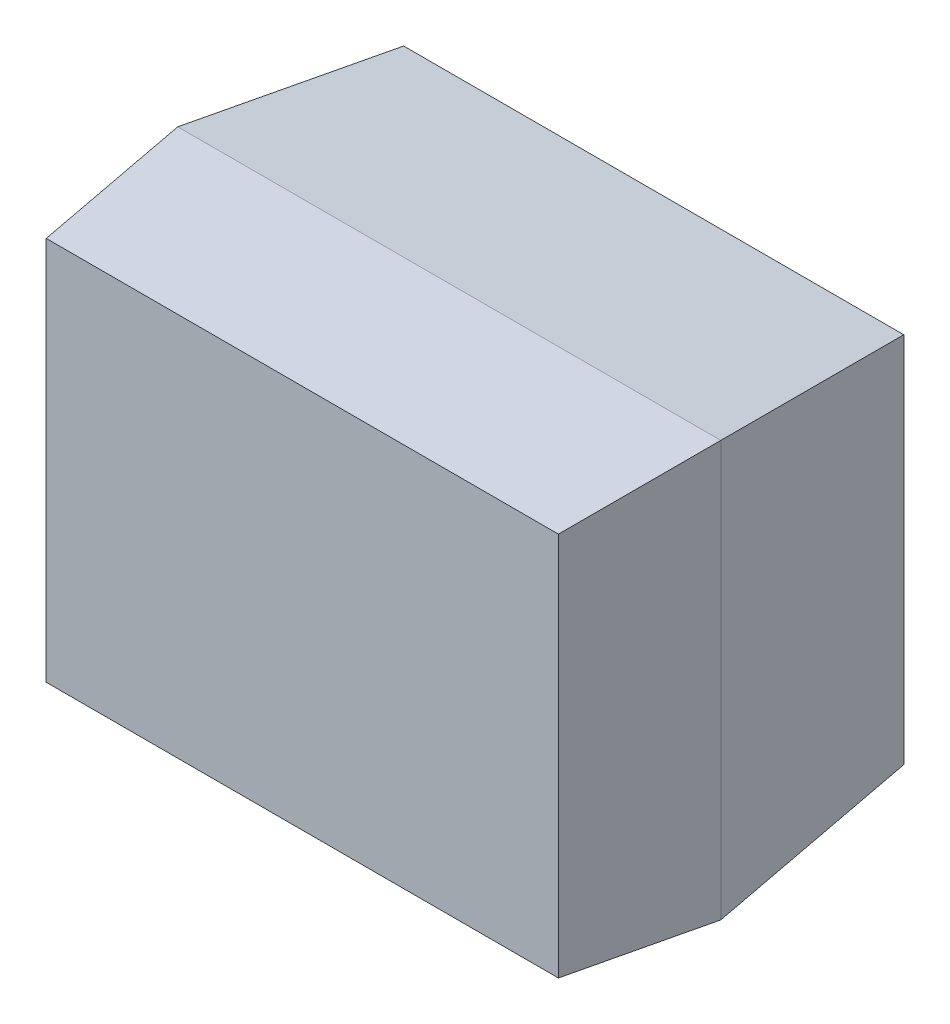
ISO-10303-21;
HEADER;
FILE_DESCRIPTION(('STEP AP214'),'2;1');
FILE_NAME('part.step','',(''),(''),'','','');
FILE_SCHEMA(('AUTOMOTIVE_DESIGN { 1 0 10303 214 1 1 1 1 }'));
ENDSEC;
DATA;
#1=APPLICATION_CONTEXT('core data for automotive mechanical design processes');
#2=APPLICATION_PROTOCOL_DEFINITION('international standard','automotive_design',2000,#1);
#3=PRODUCT_CONTEXT('',#1,'mechanical');
#4=PRODUCT('Part','Part','',(#3));
#5=PRODUCT_RELATED_PRODUCT_CATEGORY('part','',(#4));
#6=PRODUCT_DEFINITION_FORMATION('','',#4);
#7=PRODUCT_DEFINITION_CONTEXT('part definition',#1,'design');
#8=PRODUCT_DEFINITION('design','',#6,#7);
#9=PRODUCT_DEFINITION_SHAPE('','',#8);
#10=(LENGTH_UNIT() NAMED_UNIT(*) SI_UNIT(.MILLI.,.METRE.));
#11=(NAMED_UNIT(*) PLANE_ANGLE_UNIT() SI_UNIT($,.RADIAN.));
#12=(NAMED_UNIT(*) SI_UNIT($,.STERADIAN.) SOLID_ANGLE_UNIT());
#13=UNCERTAINTY_MEASURE_WITH_UNIT(LENGTH_MEASURE(1.E-05),#10,'distance_accuracy_value','');
#14=(GEOMETRIC_REPRESENTATION_CONTEXT(3) GLOBAL_UNCERTAINTY_ASSIGNED_CONTEXT((#13)) GLOBAL_UNIT_ASSIGNED_CONTEXT((#10,
#11,#12)) REPRESENTATION_CONTEXT('',''));
#15=CARTESIAN_POINT('',(0.,0.,0.));
#16=DIRECTION('',(0.,0.,1.));
#17=DIRECTION('',(1.,0.,0.));
#18=AXIS2_PLACEMENT_3D('',#15,#16,#17);
#19=CARTESIAN_POINT('',(0.425,0.616366644714984,0.42));
#20=DIRECTION('',(0.,0.994521895368273,-0.104528463267653));
#21=DIRECTION('',(0.,0.104528463267653,0.994521895368274));
#22=AXIS2_PLACEMENT_3D('',#19,#20,#21);
#23=PLANE('',#22);
#24=DIRECTION('',(-0.103962051184497,0.103962051184498,0.989132844377854));
#25=VECTOR('',#24,1.);
#26=CARTESIAN_POINT('',(-0.782733289429968,0.582733289429967,0.1));
#27=LINE('',#26,#25);
#28=CARTESIAN_POINT('',(-0.782733289429968,0.582733289429967,0.1));
#29=VERTEX_POINT('',#28);
#30=CARTESIAN_POINT('',(-0.85,0.65,0.74));
#31=VERTEX_POINT('',#30);
#32=EDGE_CURVE('E11',#29,#31,#27,.T.);
#33=ORIENTED_EDGE('',*,*,#32,.T.);
#34=DIRECTION('',(-1.,0.,0.));
#35=VECTOR('',#34,1.);
#36=CARTESIAN_POINT('',(0.85,0.65,0.74));
#37=LINE('',#36,#35);
#38=CARTESIAN_POINT('',(0.85,0.65,0.74));
#39=VERTEX_POINT('',#38);
#40=EDGE_CURVE('E123',#39,#31,#37,.T.);
#41=ORIENTED_EDGE('',*,*,#40,.F.);
#42=DIRECTION('',(-0.103962051184498,-0.103962051184498,-0.989132844377854));
#43=VECTOR('',#42,1.);
#44=CARTESIAN_POINT('',(0.85,0.65,0.74));
#45=LINE('',#44,#43);
#46=CARTESIAN_POINT('',(0.782733289429967,0.582733289429967,0.1));
#47=VERTEX_POINT('',#46);
#48=EDGE_CURVE('E121',#39,#47,#45,.T.);
#49=ORIENTED_EDGE('',*,*,#48,.T.);
#50=DIRECTION('',(-1.,0.,0.));
#51=VECTOR('',#50,1.);
#52=CARTESIAN_POINT('',(0.782733289429967,0.582733289429967,0.1));
#53=LINE('',#52,#51);
#54=EDGE_CURVE('E24',#47,#29,#53,.T.);
#55=ORIENTED_EDGE('',*,*,#54,.T.);
#56=EDGE_LOOP('',(#33,#41,#49,#55));
#57=FACE_BOUND('',#56,.T.);
#58=ADVANCED_FACE('F17',(#57),#23,.T.);
#59=CARTESIAN_POINT('',(0.85,0.,0.1));
#60=DIRECTION('',(0.,0.,-1.));
#61=DIRECTION('',(-1.,0.,0.));
#62=AXIS2_PLACEMENT_3D('',#59,#60,#61);
#63=PLANE('',#62);
#64=ORIENTED_EDGE('',*,*,#54,.F.);
#65=DIRECTION('',(0.,1.,0.));
#66=VECTOR('',#65,1.);
#67=CARTESIAN_POINT('',(0.782733289429967,-0.582733289429967,0.1));
#68=LINE('',#67,#66);
#69=CARTESIAN_POINT('',(0.782733289429967,-0.582733289429967,0.1));
#70=VERTEX_POINT('',#69);
#71=EDGE_CURVE('E118',#70,#47,#68,.T.);
#72=ORIENTED_EDGE('',*,*,#71,.F.);
#73=DIRECTION('',(1.,0.,0.));
#74=VECTOR('',#73,1.);
#75=CARTESIAN_POINT('',(-0.782733289429968,-0.582733289429967,0.0999999999999999));
#76=LINE('',#75,#74);
#77=CARTESIAN_POINT('',(-0.782733289429968,-0.582733289429967,0.1));
#78=VERTEX_POINT('',#77);
#79=EDGE_CURVE('E110',#78,#70,#76,.T.);
#80=ORIENTED_EDGE('',*,*,#79,.F.);
#81=DIRECTION('',(0.,-1.,0.));
#82=VECTOR('',#81,1.);
#83=CARTESIAN_POINT('',(-0.782733289429968,0.582733289429967,0.1));
#84=LINE('',#83,#82);
#85=EDGE_CURVE('E106',#29,#78,#84,.T.);
#86=ORIENTED_EDGE('',*,*,#85,.F.);
#87=EDGE_LOOP('',(#64,#72,#80,#86));
#88=FACE_BOUND('',#87,.T.);
#89=ADVANCED_FACE('F129',(#88),#63,.T.);
#90=CARTESIAN_POINT('',(0.816366644714983,0.,0.42));
#91=DIRECTION('',(0.994521895368273,0.,-0.104528463267654));
#92=DIRECTION('',(-0.104528463267654,0.,-0.994521895368273));
#93=AXIS2_PLACEMENT_3D('',#90,#91,#92);
#94=PLANE('',#93);
#95=ORIENTED_EDGE('',*,*,#48,.F.);
#96=DIRECTION('',(0.,1.,0.));
#97=VECTOR('',#96,1.);
#98=CARTESIAN_POINT('',(0.85,-0.65,0.74));
#99=LINE('',#98,#97);
#100=CARTESIAN_POINT('',(0.85,-0.65,0.74));
#101=VERTEX_POINT('',#100);
#102=EDGE_CURVE('E113',#101,#39,#99,.T.);
#103=ORIENTED_EDGE('',*,*,#102,.F.);
#104=DIRECTION('',(-0.103962051184498,0.103962051184498,-0.989132844377854));
#105=VECTOR('',#104,1.);
#106=CARTESIAN_POINT('',(0.85,-0.65,0.74));
#107=LINE('',#106,#105);
#108=EDGE_CURVE('E115',#101,#70,#107,.T.);
#109=ORIENTED_EDGE('',*,*,#108,.T.);
#110=ORIENTED_EDGE('',*,*,#71,.T.);
#111=EDGE_LOOP('',(#95,#103,#109,#110));
#112=FACE_BOUND('',#111,.T.);
#113=ADVANCED_FACE('F139',(#112),#94,.T.);
#114=CARTESIAN_POINT('',(0.425,-0.616366644714984,0.42));
#115=DIRECTION('',(0.,-0.994521895368273,-0.104528463267653));
#116=DIRECTION('',(0.,0.104528463267653,-0.994521895368274));
#117=AXIS2_PLACEMENT_3D('',#114,#115,#116);
#118=PLANE('',#117);
#119=ORIENTED_EDGE('',*,*,#108,.F.);
#120=DIRECTION('',(1.,0.,0.));
#121=VECTOR('',#120,1.);
#122=CARTESIAN_POINT('',(-0.85,-0.65,0.74));
#123=LINE('',#122,#121);
#124=CARTESIAN_POINT('',(-0.85,-0.65,0.74));
#125=VERTEX_POINT('',#124);
#126=EDGE_CURVE('E82',#125,#101,#123,.T.);
#127=ORIENTED_EDGE('',*,*,#126,.F.);
#128=DIRECTION('',(0.103962051184497,0.103962051184498,-0.989132844377854));
#129=VECTOR('',#128,1.);
#130=CARTESIAN_POINT('',(-0.85,-0.65,0.74));
#131=LINE('',#130,#129);
#132=EDGE_CURVE('E102',#125,#78,#131,.T.);
#133=ORIENTED_EDGE('',*,*,#132,.T.);
#134=ORIENTED_EDGE('',*,*,#79,.T.);
#135=EDGE_LOOP('',(#119,#127,#133,#134));
#136=FACE_BOUND('',#135,.T.);
#137=ADVANCED_FACE('F131',(#136),#118,.T.);
#138=CARTESIAN_POINT('',(-0.816366644714984,0.,0.42));
#139=DIRECTION('',(-0.994521895368274,0.,-0.104528463267653));
#140=DIRECTION('',(-0.104528463267653,0.,0.994521895368273));
#141=AXIS2_PLACEMENT_3D('',#138,#139,#140);
#142=PLANE('',#141);
#143=ORIENTED_EDGE('',*,*,#32,.F.);
#144=ORIENTED_EDGE('',*,*,#85,.T.);
#145=ORIENTED_EDGE('',*,*,#132,.F.);
#146=DIRECTION('',(0.,-1.,0.));
#147=VECTOR('',#146,1.);
#148=CARTESIAN_POINT('',(-0.85,0.65,0.74));
#149=LINE('',#148,#147);
#150=EDGE_CURVE('E76',#31,#125,#149,.T.);
#151=ORIENTED_EDGE('',*,*,#150,.F.);
#152=EDGE_LOOP('',(#143,#144,#145,#151));
#153=FACE_BOUND('',#152,.T.);
#154=ADVANCED_FACE('F127',(#153),#142,.T.);
#155=CARTESIAN_POINT('',(-0.425,0.625826025888895,0.97));
#156=DIRECTION('',(0.,0.994521895368273,0.104528463267653));
#157=DIRECTION('',(0.,-0.104528463267653,0.994521895368273));
#158=AXIS2_PLACEMENT_3D('',#155,#156,#157);
#159=PLANE('',#158);
#160=DIRECTION('',(0.103962051184497,0.103962051184498,-0.989132844377854));
#161=VECTOR('',#160,1.);
#162=CARTESIAN_POINT('',(0.80165205177779,0.60165205177779,1.2));
#163=LINE('',#162,#161);
#164=CARTESIAN_POINT('',(0.801652051777789,0.601652051777789,1.2));
#165=VERTEX_POINT('',#164);
#166=EDGE_CURVE('E88',#165,#39,#163,.T.);
#167=ORIENTED_EDGE('',*,*,#166,.T.);
#168=ORIENTED_EDGE('',*,*,#40,.T.);
#169=DIRECTION('',(0.103962051184498,-0.103962051184498,0.989132844377854));
#170=VECTOR('',#169,1.);
#171=CARTESIAN_POINT('',(-0.85,0.650000000000001,0.74));
#172=LINE('',#171,#170);
#173=CARTESIAN_POINT('',(-0.801652051777789,0.601652051777789,1.2));
#174=VERTEX_POINT('',#173);
#175=EDGE_CURVE('E97',#31,#174,#172,.T.);
#176=ORIENTED_EDGE('',*,*,#175,.T.);
#177=DIRECTION('',(1.,0.,0.));
#178=VECTOR('',#177,1.);
#179=CARTESIAN_POINT('',(-0.801652051777789,0.601652051777789,1.2));
#180=LINE('',#179,#178);
#181=EDGE_CURVE('E100',#174,#165,#180,.T.);
#182=ORIENTED_EDGE('',*,*,#181,.T.);
#183=EDGE_LOOP('',(#167,#168,#176,#182));
#184=FACE_BOUND('',#183,.T.);
#185=ADVANCED_FACE('F137',(#184),#159,.T.);
#186=CARTESIAN_POINT('',(-0.85,0.,1.2));
#187=DIRECTION('',(0.,0.,1.));
#188=DIRECTION('',(1.,0.,0.));
#189=AXIS2_PLACEMENT_3D('',#186,#187,#188);
#190=PLANE('',#189);
#191=ORIENTED_EDGE('',*,*,#181,.F.);
#192=DIRECTION('',(0.,1.,0.));
#193=VECTOR('',#192,1.);
#194=CARTESIAN_POINT('',(-0.801652051777789,-0.601652051777789,1.2));
#195=LINE('',#194,#193);
#196=CARTESIAN_POINT('',(-0.801652051777789,-0.601652051777789,1.2));
#197=VERTEX_POINT('',#196);
#198=EDGE_CURVE('E72',#197,#174,#195,.T.);
#199=ORIENTED_EDGE('',*,*,#198,.F.);
#200=DIRECTION('',(-1.,0.,0.));
#201=VECTOR('',#200,1.);
#202=CARTESIAN_POINT('',(0.801652051777789,-0.601652051777789,1.2));
#203=LINE('',#202,#201);
#204=CARTESIAN_POINT('',(0.801652051777789,-0.601652051777789,1.2));
#205=VERTEX_POINT('',#204);
#206=EDGE_CURVE('E66',#205,#197,#203,.T.);
#207=ORIENTED_EDGE('',*,*,#206,.F.);
#208=DIRECTION('',(0.,-1.,0.));
#209=VECTOR('',#208,1.);
#210=CARTESIAN_POINT('',(0.801652051777789,0.601652051777789,1.2));
#211=LINE('',#210,#209);
#212=EDGE_CURVE('E70',#165,#205,#211,.T.);
#213=ORIENTED_EDGE('',*,*,#212,.F.);
#214=EDGE_LOOP('',(#191,#199,#207,#213));
#215=FACE_BOUND('',#214,.T.);
#216=ADVANCED_FACE('F68',(#215),#190,.T.);
#217=CARTESIAN_POINT('',(-0.825826025888895,0.,0.97));
#218=DIRECTION('',(-0.994521895368273,0.,0.104528463267654));
#219=DIRECTION('',(0.104528463267654,0.,0.994521895368273));
#220=AXIS2_PLACEMENT_3D('',#217,#218,#219);
#221=PLANE('',#220);
#222=ORIENTED_EDGE('',*,*,#175,.F.);
#223=ORIENTED_EDGE('',*,*,#150,.T.);
#224=DIRECTION('',(-0.103962051184498,-0.103962051184498,-0.989132844377854));
#225=VECTOR('',#224,1.);
#226=CARTESIAN_POINT('',(-0.801652051777789,-0.601652051777789,1.2));
#227=LINE('',#226,#225);
#228=EDGE_CURVE('E90',#197,#125,#227,.T.);
#229=ORIENTED_EDGE('',*,*,#228,.F.);
#230=ORIENTED_EDGE('',*,*,#198,.T.);
#231=EDGE_LOOP('',(#222,#223,#229,#230));
#232=FACE_BOUND('',#231,.T.);
#233=ADVANCED_FACE('F135',(#232),#221,.T.);
#234=CARTESIAN_POINT('',(0.825826025888894,0.,0.97));
#235=DIRECTION('',(0.994521895368273,0.,0.104528463267653));
#236=DIRECTION('',(0.104528463267653,0.,-0.994521895368273));
#237=AXIS2_PLACEMENT_3D('',#234,#235,#236);
#238=PLANE('',#237);
#239=ORIENTED_EDGE('',*,*,#166,.F.);
#240=ORIENTED_EDGE('',*,*,#212,.T.);
#241=DIRECTION('',(0.103962051184497,-0.103962051184498,-0.989132844377854));
#242=VECTOR('',#241,1.);
#243=CARTESIAN_POINT('',(0.80165205177779,-0.601652051777789,1.2));
#244=LINE('',#243,#242);
#245=EDGE_CURVE('E77',#205,#101,#244,.T.);
#246=ORIENTED_EDGE('',*,*,#245,.T.);
#247=ORIENTED_EDGE('',*,*,#102,.T.);
#248=EDGE_LOOP('',(#239,#240,#246,#247));
#249=FACE_BOUND('',#248,.T.);
#250=ADVANCED_FACE('F86',(#249),#238,.T.);
#251=CARTESIAN_POINT('',(-0.425,-0.625826025888895,0.97));
#252=DIRECTION('',(0.,-0.994521895368273,0.104528463267653));
#253=DIRECTION('',(0.,-0.104528463267653,-0.994521895368273));
#254=AXIS2_PLACEMENT_3D('',#251,#252,#253);
#255=PLANE('',#254);
#256=ORIENTED_EDGE('',*,*,#245,.F.);
#257=ORIENTED_EDGE('',*,*,#206,.T.);
#258=ORIENTED_EDGE('',*,*,#228,.T.);
#259=ORIENTED_EDGE('',*,*,#126,.T.);
#260=EDGE_LOOP('',(#256,#257,#258,#259));
#261=FACE_BOUND('',#260,.T.);
#262=ADVANCED_FACE('F81',(#261),#255,.T.);
#263=CLOSED_SHELL('',(#58,#89,#113,#137,#154,#185,#216,#233,#250,#262));
#264=MANIFOLD_SOLID_BREP('B1',#263);
#265=ADVANCED_BREP_SHAPE_REPRESENTATION('',(#18,#264),#14);
#266=SHAPE_DEFINITION_REPRESENTATION(#9,#265);
ENDSEC;
END-ISO-10303-21;
